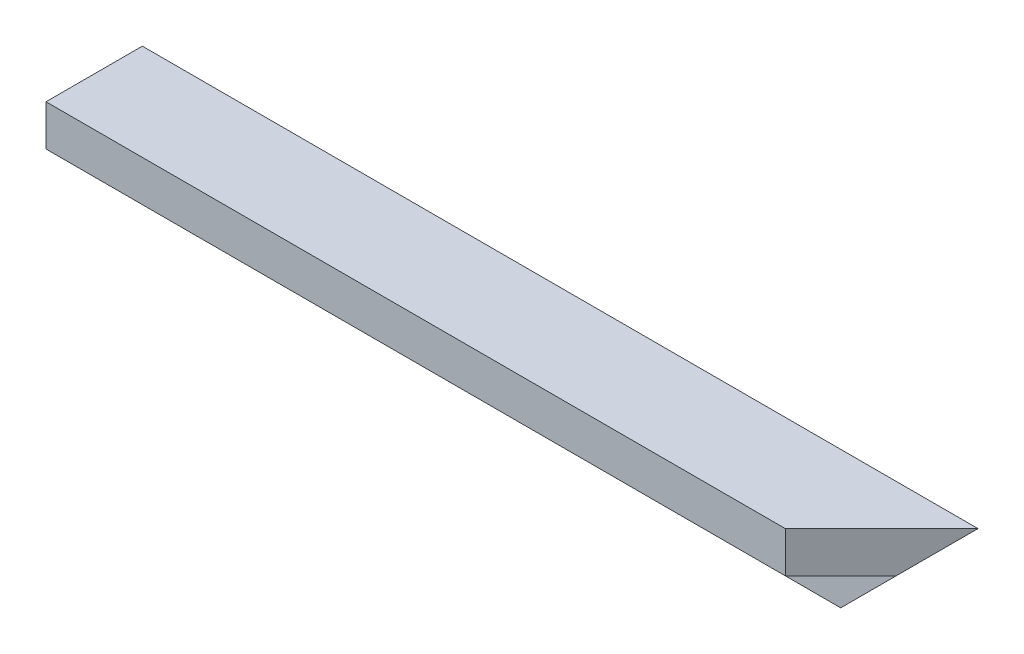
ISO-10303-21;
HEADER;
FILE_DESCRIPTION(('STEP AP214'),'2;1');
FILE_NAME('part.step','',(''),(''),'','','');
FILE_SCHEMA(('AUTOMOTIVE_DESIGN { 1 0 10303 214 1 1 1 1 }'));
ENDSEC;
DATA;
#1=APPLICATION_CONTEXT('core data for automotive mechanical design processes');
#2=APPLICATION_PROTOCOL_DEFINITION('international standard','automotive_design',2000,#1);
#3=PRODUCT_CONTEXT('',#1,'mechanical');
#4=PRODUCT('Part','Part','',(#3));
#5=PRODUCT_RELATED_PRODUCT_CATEGORY('part','',(#4));
#6=PRODUCT_DEFINITION_FORMATION('','',#4);
#7=PRODUCT_DEFINITION_CONTEXT('part definition',#1,'design');
#8=PRODUCT_DEFINITION('design','',#6,#7);
#9=PRODUCT_DEFINITION_SHAPE('','',#8);
#10=(LENGTH_UNIT() NAMED_UNIT(*) SI_UNIT(.MILLI.,.METRE.));
#11=(NAMED_UNIT(*) PLANE_ANGLE_UNIT() SI_UNIT($,.RADIAN.));
#12=(NAMED_UNIT(*) SI_UNIT($,.STERADIAN.) SOLID_ANGLE_UNIT());
#13=UNCERTAINTY_MEASURE_WITH_UNIT(LENGTH_MEASURE(1.E-05),#10,'distance_accuracy_value','');
#14=(GEOMETRIC_REPRESENTATION_CONTEXT(3) GLOBAL_UNCERTAINTY_ASSIGNED_CONTEXT((#13)) GLOBAL_UNIT_ASSIGNED_CONTEXT((#10,
#11,#12)) REPRESENTATION_CONTEXT('',''));
#15=CARTESIAN_POINT('',(0.,0.,0.));
#16=DIRECTION('',(0.,0.,1.));
#17=DIRECTION('',(1.,0.,0.));
#18=AXIS2_PLACEMENT_3D('',#15,#16,#17);
#19=CARTESIAN_POINT('',(222.000000000001,-40.,0.));
#20=DIRECTION('',(0.,0.,1.));
#21=DIRECTION('',(1.,0.,0.));
#22=AXIS2_PLACEMENT_3D('',#19,#20,#21);
#23=PLANE('',#22);
#24=DIRECTION('',(-1.,0.,0.));
#25=VECTOR('',#24,1.);
#26=CARTESIAN_POINT('',(222.000000000001,0.,0.));
#27=LINE('',#26,#25);
#28=CARTESIAN_POINT('',(222.,0.,0.));
#29=VERTEX_POINT('',#28);
#30=CARTESIAN_POINT('',(-124.999999999999,0.,0.));
#31=VERTEX_POINT('',#30);
#32=EDGE_CURVE('E40',#29,#31,#27,.T.);
#33=ORIENTED_EDGE('',*,*,#32,.F.);
#34=DIRECTION('',(0.707106781186548,0.707106781186547,0.));
#35=VECTOR('',#34,1.);
#36=CARTESIAN_POINT('',(222.,0.,0.));
#37=LINE('',#36,#35);
#38=CARTESIAN_POINT('',(182.,-40.,0.));
#39=VERTEX_POINT('',#38);
#40=EDGE_CURVE('E88',#39,#29,#37,.T.);
#41=ORIENTED_EDGE('',*,*,#40,.F.);
#42=DIRECTION('',(-1.,0.,0.));
#43=VECTOR('',#42,1.);
#44=CARTESIAN_POINT('',(222.000000000001,-40.,0.));
#45=LINE('',#44,#43);
#46=CARTESIAN_POINT('',(-124.999999999999,-40.,0.));
#47=VERTEX_POINT('',#46);
#48=EDGE_CURVE('E47',#39,#47,#45,.T.);
#49=ORIENTED_EDGE('',*,*,#48,.T.);
#50=DIRECTION('',(0.,1.,0.));
#51=VECTOR('',#50,1.);
#52=CARTESIAN_POINT('',(-124.999999999999,-40.,0.));
#53=LINE('',#52,#51);
#54=EDGE_CURVE('E118',#47,#31,#53,.T.);
#55=ORIENTED_EDGE('',*,*,#54,.T.);
#56=EDGE_LOOP('',(#33,#41,#49,#55));
#57=FACE_BOUND('',#56,.T.);
#58=ADVANCED_FACE('F33',(#57),#23,.F.);
#59=CARTESIAN_POINT('',(222.000000000001,0.,0.));
#60=DIRECTION('',(0.,-1.,0.));
#61=DIRECTION('',(0.,0.,-1.));
#62=AXIS2_PLACEMENT_3D('',#59,#60,#61);
#63=PLANE('',#62);
#64=DIRECTION('',(-1.,0.,0.));
#65=VECTOR('',#64,1.);
#66=CARTESIAN_POINT('',(222.000000000001,0.,40.));
#67=LINE('',#66,#65);
#68=CARTESIAN_POINT('',(182.,0.,40.));
#69=VERTEX_POINT('',#68);
#70=CARTESIAN_POINT('',(-124.999999999999,0.,40.));
#71=VERTEX_POINT('',#70);
#72=EDGE_CURVE('E109',#69,#71,#67,.T.);
#73=ORIENTED_EDGE('',*,*,#72,.F.);
#74=DIRECTION('',(-0.707106781186548,0.,0.707106781186547));
#75=VECTOR('',#74,1.);
#76=CARTESIAN_POINT('',(222.,0.,0.));
#77=LINE('',#76,#75);
#78=EDGE_CURVE('E117',#29,#69,#77,.T.);
#79=ORIENTED_EDGE('',*,*,#78,.F.);
#80=ORIENTED_EDGE('',*,*,#32,.T.);
#81=DIRECTION('',(0.,0.,1.));
#82=VECTOR('',#81,1.);
#83=CARTESIAN_POINT('',(-124.999999999999,0.,0.));
#84=LINE('',#83,#82);
#85=EDGE_CURVE('E115',#31,#71,#84,.T.);
#86=ORIENTED_EDGE('',*,*,#85,.T.);
#87=EDGE_LOOP('',(#73,#79,#80,#86));
#88=FACE_BOUND('',#87,.T.);
#89=ADVANCED_FACE('F114',(#88),#63,.F.);
#90=CARTESIAN_POINT('',(222.000000000001,0.,40.));
#91=DIRECTION('',(0.,0.,-1.));
#92=DIRECTION('',(-1.,0.,0.));
#93=AXIS2_PLACEMENT_3D('',#90,#91,#92);
#94=PLANE('',#93);
#95=DIRECTION('',(-1.,0.,0.));
#96=VECTOR('',#95,1.);
#97=CARTESIAN_POINT('',(222.000000000001,-17.,40.));
#98=LINE('',#97,#96);
#99=CARTESIAN_POINT('',(182.,-17.,40.));
#100=VERTEX_POINT('',#99);
#101=CARTESIAN_POINT('',(-124.999999999999,-17.,40.));
#102=VERTEX_POINT('',#101);
#103=EDGE_CURVE('E107',#100,#102,#98,.T.);
#104=ORIENTED_EDGE('',*,*,#103,.F.);
#105=DIRECTION('',(0.,1.,0.));
#106=VECTOR('',#105,1.);
#107=CARTESIAN_POINT('',(182.,-40.,40.));
#108=LINE('',#107,#106);
#109=EDGE_CURVE('E125',#100,#69,#108,.T.);
#110=ORIENTED_EDGE('',*,*,#109,.T.);
#111=ORIENTED_EDGE('',*,*,#72,.T.);
#112=DIRECTION('',(0.,-1.,0.));
#113=VECTOR('',#112,1.);
#114=CARTESIAN_POINT('',(-124.999999999999,0.,40.));
#115=LINE('',#114,#113);
#116=EDGE_CURVE('E122',#71,#102,#115,.T.);
#117=ORIENTED_EDGE('',*,*,#116,.T.);
#118=EDGE_LOOP('',(#104,#110,#111,#117));
#119=FACE_BOUND('',#118,.T.);
#120=ADVANCED_FACE('F153',(#119),#94,.F.);
#121=CARTESIAN_POINT('',(222.000000000001,-17.,40.));
#122=DIRECTION('',(0.,1.,0.));
#123=DIRECTION('',(0.,0.,1.));
#124=AXIS2_PLACEMENT_3D('',#121,#122,#123);
#125=PLANE('',#124);
#126=DIRECTION('',(-1.,0.,0.));
#127=VECTOR('',#126,1.);
#128=CARTESIAN_POINT('',(222.000000000001,-17.,17.));
#129=LINE('',#128,#127);
#130=CARTESIAN_POINT('',(205.,-17.,17.));
#131=VERTEX_POINT('',#130);
#132=CARTESIAN_POINT('',(-124.999999999999,-17.,17.));
#133=VERTEX_POINT('',#132);
#134=EDGE_CURVE('E100',#131,#133,#129,.T.);
#135=ORIENTED_EDGE('',*,*,#134,.F.);
#136=DIRECTION('',(-0.707106781186548,0.,0.707106781186548));
#137=VECTOR('',#136,1.);
#138=CARTESIAN_POINT('',(202.000000000001,-17.,19.9999999999995));
#139=LINE('',#138,#137);
#140=EDGE_CURVE('E120',#131,#100,#139,.T.);
#141=ORIENTED_EDGE('',*,*,#140,.T.);
#142=ORIENTED_EDGE('',*,*,#103,.T.);
#143=DIRECTION('',(0.,0.,-1.));
#144=VECTOR('',#143,1.);
#145=CARTESIAN_POINT('',(-124.999999999999,-17.,40.));
#146=LINE('',#145,#144);
#147=EDGE_CURVE('E131',#102,#133,#146,.T.);
#148=ORIENTED_EDGE('',*,*,#147,.T.);
#149=EDGE_LOOP('',(#135,#141,#142,#148));
#150=FACE_BOUND('',#149,.T.);
#151=ADVANCED_FACE('F157',(#150),#125,.F.);
#152=CARTESIAN_POINT('',(222.000000000001,-17.,17.));
#153=DIRECTION('',(0.,0.,-1.));
#154=DIRECTION('',(0.,1.,0.));
#155=AXIS2_PLACEMENT_3D('',#152,#153,#154);
#156=PLANE('',#155);
#157=DIRECTION('',(-1.,0.,0.));
#158=VECTOR('',#157,1.);
#159=CARTESIAN_POINT('',(222.000000000001,-40.,17.));
#160=LINE('',#159,#158);
#161=CARTESIAN_POINT('',(182.,-40.,17.));
#162=VERTEX_POINT('',#161);
#163=CARTESIAN_POINT('',(-124.999999999999,-40.,17.));
#164=VERTEX_POINT('',#163);
#165=EDGE_CURVE('E54',#162,#164,#160,.T.);
#166=ORIENTED_EDGE('',*,*,#165,.F.);
#167=DIRECTION('',(0.707106781186548,0.707106781186547,0.));
#168=VECTOR('',#167,1.);
#169=CARTESIAN_POINT('',(213.500000000001,-8.49999999999946,17.));
#170=LINE('',#169,#168);
#171=EDGE_CURVE('E90',#162,#131,#170,.T.);
#172=ORIENTED_EDGE('',*,*,#171,.T.);
#173=ORIENTED_EDGE('',*,*,#134,.T.);
#174=DIRECTION('',(0.,-1.,0.));
#175=VECTOR('',#174,1.);
#176=CARTESIAN_POINT('',(-124.999999999999,-17.,17.));
#177=LINE('',#176,#175);
#178=EDGE_CURVE('E102',#133,#164,#177,.T.);
#179=ORIENTED_EDGE('',*,*,#178,.T.);
#180=EDGE_LOOP('',(#166,#172,#173,#179));
#181=FACE_BOUND('',#180,.T.);
#182=ADVANCED_FACE('F135',(#181),#156,.F.);
#183=CARTESIAN_POINT('',(222.000000000001,-40.,17.));
#184=DIRECTION('',(0.,1.,0.));
#185=DIRECTION('',(0.,0.,1.));
#186=AXIS2_PLACEMENT_3D('',#183,#184,#185);
#187=PLANE('',#186);
#188=ORIENTED_EDGE('',*,*,#48,.F.);
#189=DIRECTION('',(0.,0.,-1.));
#190=VECTOR('',#189,1.);
#191=CARTESIAN_POINT('',(182.,-40.,40.));
#192=LINE('',#191,#190);
#193=EDGE_CURVE('E86',#162,#39,#192,.T.);
#194=ORIENTED_EDGE('',*,*,#193,.F.);
#195=ORIENTED_EDGE('',*,*,#165,.T.);
#196=DIRECTION('',(0.,0.,-1.));
#197=VECTOR('',#196,1.);
#198=CARTESIAN_POINT('',(-124.999999999999,-40.,17.));
#199=LINE('',#198,#197);
#200=EDGE_CURVE('E97',#164,#47,#199,.T.);
#201=ORIENTED_EDGE('',*,*,#200,.T.);
#202=EDGE_LOOP('',(#188,#194,#195,#201));
#203=FACE_BOUND('',#202,.T.);
#204=ADVANCED_FACE('F95',(#203),#187,.F.);
#205=CARTESIAN_POINT('',(-124.999999999999,0.,0.));
#206=DIRECTION('',(1.,0.,0.));
#207=DIRECTION('',(0.,0.,-1.));
#208=AXIS2_PLACEMENT_3D('',#205,#206,#207);
#209=PLANE('',#208);
#210=ORIENTED_EDGE('',*,*,#54,.F.);
#211=ORIENTED_EDGE('',*,*,#200,.F.);
#212=ORIENTED_EDGE('',*,*,#178,.F.);
#213=ORIENTED_EDGE('',*,*,#147,.F.);
#214=ORIENTED_EDGE('',*,*,#116,.F.);
#215=ORIENTED_EDGE('',*,*,#85,.F.);
#216=EDGE_LOOP('',(#210,#211,#212,#213,#214,#215));
#217=FACE_BOUND('',#216,.T.);
#218=ADVANCED_FACE('F138',(#217),#209,.F.);
#219=CARTESIAN_POINT('',(222.,-40.,0.));
#220=DIRECTION('',(-0.707106781186548,0.,-0.707106781186548));
#221=DIRECTION('',(-0.707106781186548,0.,0.707106781186548));
#222=AXIS2_PLACEMENT_3D('',#219,#220,#221);
#223=PLANE('',#222);
#224=ORIENTED_EDGE('',*,*,#140,.F.);
#225=DIRECTION('',(0.577350269189626,0.577350269189626,-0.577350269189626));
#226=VECTOR('',#225,1.);
#227=CARTESIAN_POINT('',(208.666666666667,-13.3333333333333,13.3333333333333));
#228=LINE('',#227,#226);
#229=EDGE_CURVE('E11',#131,#29,#228,.T.);
#230=ORIENTED_EDGE('',*,*,#229,.T.);
#231=ORIENTED_EDGE('',*,*,#78,.T.);
#232=ORIENTED_EDGE('',*,*,#109,.F.);
#233=EDGE_LOOP('',(#224,#230,#231,#232));
#234=FACE_BOUND('',#233,.T.);
#235=ADVANCED_FACE('F140',(#234),#223,.F.);
#236=CARTESIAN_POINT('',(222.,0.,40.));
#237=DIRECTION('',(-0.707106781186547,0.707106781186548,0.));
#238=DIRECTION('',(-0.707106781186548,-0.707106781186547,0.));
#239=AXIS2_PLACEMENT_3D('',#236,#237,#238);
#240=PLANE('',#239);
#241=ORIENTED_EDGE('',*,*,#193,.T.);
#242=ORIENTED_EDGE('',*,*,#40,.T.);
#243=ORIENTED_EDGE('',*,*,#229,.F.);
#244=ORIENTED_EDGE('',*,*,#171,.F.);
#245=EDGE_LOOP('',(#241,#242,#243,#244));
#246=FACE_BOUND('',#245,.T.);
#247=ADVANCED_FACE('F87',(#246),#240,.F.);
#248=CLOSED_SHELL('',(#58,#89,#120,#151,#182,#204,#218,#235,#247));
#249=MANIFOLD_SOLID_BREP('B2',#248);
#250=ADVANCED_BREP_SHAPE_REPRESENTATION('',(#18,#249),#14);
#251=SHAPE_DEFINITION_REPRESENTATION(#9,#250);
ENDSEC;
END-ISO-10303-21;
